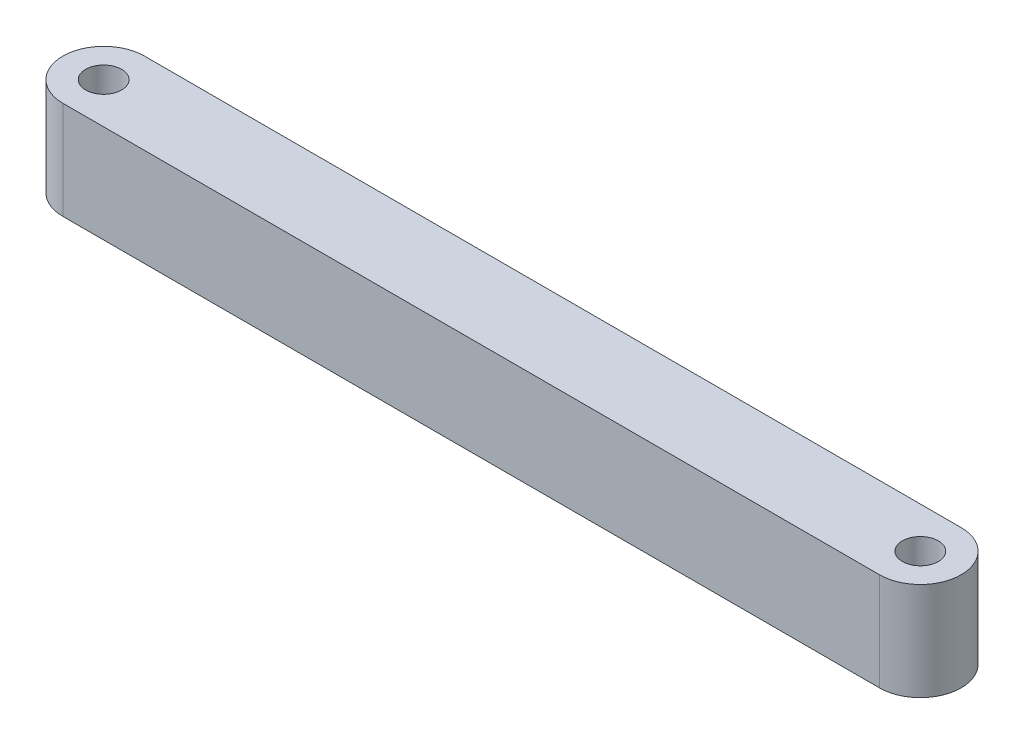
ISO-10303-21;
HEADER;
FILE_DESCRIPTION(('STEP AP214'),'2;1');
FILE_NAME('part.step','',(''),(''),'','','');
FILE_SCHEMA(('AUTOMOTIVE_DESIGN { 1 0 10303 214 1 1 1 1 }'));
ENDSEC;
DATA;
#1=APPLICATION_CONTEXT('core data for automotive mechanical design processes');
#2=APPLICATION_PROTOCOL_DEFINITION('international standard','automotive_design',2000,#1);
#3=PRODUCT_CONTEXT('',#1,'mechanical');
#4=PRODUCT('Part','Part','',(#3));
#5=PRODUCT_RELATED_PRODUCT_CATEGORY('part','',(#4));
#6=PRODUCT_DEFINITION_FORMATION('','',#4);
#7=PRODUCT_DEFINITION_CONTEXT('part definition',#1,'design');
#8=PRODUCT_DEFINITION('design','',#6,#7);
#9=PRODUCT_DEFINITION_SHAPE('','',#8);
#10=(LENGTH_UNIT() NAMED_UNIT(*) SI_UNIT(.MILLI.,.METRE.));
#11=(NAMED_UNIT(*) PLANE_ANGLE_UNIT() SI_UNIT($,.RADIAN.));
#12=(NAMED_UNIT(*) SI_UNIT($,.STERADIAN.) SOLID_ANGLE_UNIT());
#13=UNCERTAINTY_MEASURE_WITH_UNIT(LENGTH_MEASURE(1.E-05),#10,'distance_accuracy_value','');
#14=(GEOMETRIC_REPRESENTATION_CONTEXT(3) GLOBAL_UNCERTAINTY_ASSIGNED_CONTEXT((#13)) GLOBAL_UNIT_ASSIGNED_CONTEXT((#10,
#11,#12)) REPRESENTATION_CONTEXT('',''));
#15=CARTESIAN_POINT('',(0.,0.,0.));
#16=DIRECTION('',(0.,0.,1.));
#17=DIRECTION('',(1.,0.,0.));
#18=AXIS2_PLACEMENT_3D('',#15,#16,#17);
#19=CARTESIAN_POINT('',(93.4644845110648,12.,1.41905282731919));
#20=DIRECTION('',(0.,-1.,0.));
#21=DIRECTION('',(0.,0.,-1.));
#22=AXIS2_PLACEMENT_3D('',#19,#20,#21);
#23=CYLINDRICAL_SURFACE('',#22,2.2);
#24=CARTESIAN_POINT('',(93.4644845110648,12.,1.41905282731919));
#25=DIRECTION('',(0.,1.,0.));
#26=DIRECTION('',(0.,0.,1.));
#27=AXIS2_PLACEMENT_3D('',#24,#25,#26);
#28=CIRCLE('',#27,2.2);
#29=CARTESIAN_POINT('',(93.4644845110648,12.,3.61905282731919));
#30=VERTEX_POINT('',#29);
#31=EDGE_CURVE('E150',#30,#30,#28,.T.);
#32=ORIENTED_EDGE('',*,*,#31,.T.);
#33=EDGE_LOOP('',(#32));
#34=FACE_BOUND('',#33,.T.);
#35=CARTESIAN_POINT('',(93.4644845110648,0.,1.41905282731919));
#36=DIRECTION('',(0.,1.,0.));
#37=DIRECTION('',(0.,0.,1.));
#38=AXIS2_PLACEMENT_3D('',#35,#36,#37);
#39=CIRCLE('',#38,2.2);
#40=CARTESIAN_POINT('',(93.4644845110648,0.,3.61905282731919));
#41=VERTEX_POINT('',#40);
#42=EDGE_CURVE('E166',#41,#41,#39,.T.);
#43=ORIENTED_EDGE('',*,*,#42,.F.);
#44=EDGE_LOOP('',(#43));
#45=FACE_BOUND('',#44,.T.);
#46=ADVANCED_FACE('F83',(#34,#45),#23,.F.);
#47=CARTESIAN_POINT('',(93.4644845110648,12.,1.41905282731919));
#48=DIRECTION('',(0.,-1.,0.));
#49=DIRECTION('',(0.,0.,-1.));
#50=AXIS2_PLACEMENT_3D('',#47,#48,#49);
#51=CYLINDRICAL_SURFACE('',#50,4.99999999999999);
#52=CARTESIAN_POINT('',(93.4644845110648,0.,1.41905282731919));
#53=DIRECTION('',(0.,1.,0.));
#54=DIRECTION('',(0.,0.,1.));
#55=AXIS2_PLACEMENT_3D('',#52,#53,#54);
#56=CIRCLE('',#55,4.99999999999999);
#57=CARTESIAN_POINT('',(93.4644845110648,0.,6.41905282731918));
#58=VERTEX_POINT('',#57);
#59=CARTESIAN_POINT('',(93.4644845110648,0.,-3.5809471726808));
#60=VERTEX_POINT('',#59);
#61=EDGE_CURVE('E142',#58,#60,#56,.T.);
#62=ORIENTED_EDGE('',*,*,#61,.T.);
#63=DIRECTION('',(0.,-1.,0.));
#64=VECTOR('',#63,1.);
#65=CARTESIAN_POINT('',(93.4644845110648,12.,-3.5809471726808));
#66=LINE('',#65,#64);
#67=CARTESIAN_POINT('',(93.4644845110648,12.,-3.5809471726808));
#68=VERTEX_POINT('',#67);
#69=EDGE_CURVE('E94',#68,#60,#66,.T.);
#70=ORIENTED_EDGE('',*,*,#69,.F.);
#71=CARTESIAN_POINT('',(93.4644845110648,12.,1.41905282731919));
#72=DIRECTION('',(0.,1.,0.));
#73=DIRECTION('',(0.,0.,1.));
#74=AXIS2_PLACEMENT_3D('',#71,#72,#73);
#75=CIRCLE('',#74,4.99999999999999);
#76=CARTESIAN_POINT('',(93.4644845110648,12.,6.41905282731918));
#77=VERTEX_POINT('',#76);
#78=EDGE_CURVE('E128',#77,#68,#75,.T.);
#79=ORIENTED_EDGE('',*,*,#78,.F.);
#80=DIRECTION('',(0.,-1.,0.));
#81=VECTOR('',#80,1.);
#82=CARTESIAN_POINT('',(93.4644845110648,12.,6.41905282731918));
#83=LINE('',#82,#81);
#84=EDGE_CURVE('E12',#77,#58,#83,.T.);
#85=ORIENTED_EDGE('',*,*,#84,.T.);
#86=EDGE_LOOP('',(#62,#70,#79,#85));
#87=FACE_BOUND('',#86,.T.);
#88=ADVANCED_FACE('F141',(#87),#51,.T.);
#89=CARTESIAN_POINT('',(0.,12.,-3.580947172681));
#90=DIRECTION('',(0.,0.,1.));
#91=DIRECTION('',(1.,0.,0.));
#92=AXIS2_PLACEMENT_3D('',#89,#90,#91);
#93=PLANE('',#92);
#94=DIRECTION('',(-1.,0.,0.));
#95=VECTOR('',#94,1.);
#96=CARTESIAN_POINT('',(0.,0.,-3.580947172681));
#97=LINE('',#96,#95);
#98=CARTESIAN_POINT('',(-6.53551548893521,0.,-3.58094717268081));
#99=VERTEX_POINT('',#98);
#100=EDGE_CURVE('E163',#60,#99,#97,.T.);
#101=ORIENTED_EDGE('',*,*,#100,.T.);
#102=DIRECTION('',(0.,-1.,0.));
#103=VECTOR('',#102,1.);
#104=CARTESIAN_POINT('',(-6.53551548893521,12.,-3.58094717268081));
#105=LINE('',#104,#103);
#106=CARTESIAN_POINT('',(-6.53551548893521,12.,-3.58094717268081));
#107=VERTEX_POINT('',#106);
#108=EDGE_CURVE('E117',#107,#99,#105,.T.);
#109=ORIENTED_EDGE('',*,*,#108,.F.);
#110=DIRECTION('',(-1.,0.,0.));
#111=VECTOR('',#110,1.);
#112=CARTESIAN_POINT('',(0.,12.,-3.580947172681));
#113=LINE('',#112,#111);
#114=EDGE_CURVE('E135',#68,#107,#113,.T.);
#115=ORIENTED_EDGE('',*,*,#114,.F.);
#116=ORIENTED_EDGE('',*,*,#69,.T.);
#117=EDGE_LOOP('',(#101,#109,#115,#116));
#118=FACE_BOUND('',#117,.T.);
#119=ADVANCED_FACE('F148',(#118),#93,.F.);
#120=CARTESIAN_POINT('',(0.,12.,6.41905282731919));
#121=DIRECTION('',(0.,0.,-1.));
#122=DIRECTION('',(-1.,0.,0.));
#123=AXIS2_PLACEMENT_3D('',#120,#121,#122);
#124=PLANE('',#123);
#125=DIRECTION('',(1.,0.,0.));
#126=VECTOR('',#125,1.);
#127=CARTESIAN_POINT('',(0.,0.,6.41905282731919));
#128=LINE('',#127,#126);
#129=CARTESIAN_POINT('',(-6.53551548893521,0.,6.41905282731919));
#130=VERTEX_POINT('',#129);
#131=EDGE_CURVE('E157',#130,#58,#128,.T.);
#132=ORIENTED_EDGE('',*,*,#131,.T.);
#133=ORIENTED_EDGE('',*,*,#84,.F.);
#134=DIRECTION('',(1.,0.,0.));
#135=VECTOR('',#134,1.);
#136=CARTESIAN_POINT('',(0.,12.,6.41905282731919));
#137=LINE('',#136,#135);
#138=CARTESIAN_POINT('',(-6.53551548893521,12.,6.41905282731919));
#139=VERTEX_POINT('',#138);
#140=EDGE_CURVE('E136',#139,#77,#137,.T.);
#141=ORIENTED_EDGE('',*,*,#140,.F.);
#142=DIRECTION('',(0.,-1.,0.));
#143=VECTOR('',#142,1.);
#144=CARTESIAN_POINT('',(-6.53551548893521,12.,6.41905282731919));
#145=LINE('',#144,#143);
#146=EDGE_CURVE('E103',#139,#130,#145,.T.);
#147=ORIENTED_EDGE('',*,*,#146,.T.);
#148=EDGE_LOOP('',(#132,#133,#141,#147));
#149=FACE_BOUND('',#148,.T.);
#150=ADVANCED_FACE('F187',(#149),#124,.F.);
#151=CARTESIAN_POINT('',(0.,0.,0.));
#152=DIRECTION('',(0.,1.,0.));
#153=DIRECTION('',(0.,0.,1.));
#154=AXIS2_PLACEMENT_3D('',#151,#152,#153);
#155=PLANE('',#154);
#156=ORIENTED_EDGE('',*,*,#131,.F.);
#157=CARTESIAN_POINT('',(-6.53551548893521,0.,1.41905282731919));
#158=DIRECTION('',(0.,1.,0.));
#159=DIRECTION('',(0.,0.,1.));
#160=AXIS2_PLACEMENT_3D('',#157,#158,#159);
#161=CIRCLE('',#160,5.);
#162=EDGE_CURVE('E87',#99,#130,#161,.T.);
#163=ORIENTED_EDGE('',*,*,#162,.F.);
#164=ORIENTED_EDGE('',*,*,#100,.F.);
#165=ORIENTED_EDGE('',*,*,#61,.F.);
#166=EDGE_LOOP('',(#156,#163,#164,#165));
#167=FACE_BOUND('',#166,.T.);
#168=ORIENTED_EDGE('',*,*,#42,.T.);
#169=EDGE_LOOP('',(#168));
#170=FACE_BOUND('',#169,.T.);
#171=CARTESIAN_POINT('',(-6.53551548893521,0.,1.41905282731919));
#172=DIRECTION('',(0.,1.,0.));
#173=DIRECTION('',(0.,0.,1.));
#174=AXIS2_PLACEMENT_3D('',#171,#172,#173);
#175=CIRCLE('',#174,2.2);
#176=CARTESIAN_POINT('',(-6.53551548893521,0.,3.61905282731919));
#177=VERTEX_POINT('',#176);
#178=EDGE_CURVE('E178',#177,#177,#175,.T.);
#179=ORIENTED_EDGE('',*,*,#178,.T.);
#180=EDGE_LOOP('',(#179));
#181=FACE_BOUND('',#180,.T.);
#182=ADVANCED_FACE('F185',(#167,#170,#181),#155,.F.);
#183=CARTESIAN_POINT('',(0.,12.,0.));
#184=DIRECTION('',(0.,1.,0.));
#185=DIRECTION('',(0.,0.,1.));
#186=AXIS2_PLACEMENT_3D('',#183,#184,#185);
#187=PLANE('',#186);
#188=ORIENTED_EDGE('',*,*,#140,.T.);
#189=ORIENTED_EDGE('',*,*,#78,.T.);
#190=ORIENTED_EDGE('',*,*,#114,.T.);
#191=CARTESIAN_POINT('',(-6.53551548893521,12.,1.41905282731919));
#192=DIRECTION('',(0.,1.,0.));
#193=DIRECTION('',(0.,0.,1.));
#194=AXIS2_PLACEMENT_3D('',#191,#192,#193);
#195=CIRCLE('',#194,5.);
#196=EDGE_CURVE('E160',#107,#139,#195,.T.);
#197=ORIENTED_EDGE('',*,*,#196,.T.);
#198=EDGE_LOOP('',(#188,#189,#190,#197));
#199=FACE_BOUND('',#198,.T.);
#200=ORIENTED_EDGE('',*,*,#31,.F.);
#201=EDGE_LOOP('',(#200));
#202=FACE_BOUND('',#201,.T.);
#203=CARTESIAN_POINT('',(-6.53551548893521,12.,1.41905282731919));
#204=DIRECTION('',(0.,1.,0.));
#205=DIRECTION('',(0.,0.,1.));
#206=AXIS2_PLACEMENT_3D('',#203,#204,#205);
#207=CIRCLE('',#206,2.2);
#208=CARTESIAN_POINT('',(-6.53551548893521,12.,3.61905282731919));
#209=VERTEX_POINT('',#208);
#210=EDGE_CURVE('E174',#209,#209,#207,.T.);
#211=ORIENTED_EDGE('',*,*,#210,.F.);
#212=EDGE_LOOP('',(#211));
#213=FACE_BOUND('',#212,.T.);
#214=ADVANCED_FACE('F132',(#199,#202,#213),#187,.T.);
#215=CARTESIAN_POINT('',(-6.53551548893521,12.,1.41905282731919));
#216=DIRECTION('',(0.,-1.,0.));
#217=DIRECTION('',(0.,0.,-1.));
#218=AXIS2_PLACEMENT_3D('',#215,#216,#217);
#219=CYLINDRICAL_SURFACE('',#218,2.2);
#220=ORIENTED_EDGE('',*,*,#210,.T.);
#221=EDGE_LOOP('',(#220));
#222=FACE_BOUND('',#221,.T.);
#223=ORIENTED_EDGE('',*,*,#178,.F.);
#224=EDGE_LOOP('',(#223));
#225=FACE_BOUND('',#224,.T.);
#226=ADVANCED_FACE('F207',(#222,#225),#219,.F.);
#227=CARTESIAN_POINT('',(-6.53551548893521,12.,1.41905282731919));
#228=DIRECTION('',(0.,-1.,0.));
#229=DIRECTION('',(0.,0.,-1.));
#230=AXIS2_PLACEMENT_3D('',#227,#228,#229);
#231=CYLINDRICAL_SURFACE('',#230,5.);
#232=ORIENTED_EDGE('',*,*,#162,.T.);
#233=ORIENTED_EDGE('',*,*,#146,.F.);
#234=ORIENTED_EDGE('',*,*,#196,.F.);
#235=ORIENTED_EDGE('',*,*,#108,.T.);
#236=EDGE_LOOP('',(#232,#233,#234,#235));
#237=FACE_BOUND('',#236,.T.);
#238=ADVANCED_FACE('F85',(#237),#231,.T.);
#239=CLOSED_SHELL('',(#46,#88,#119,#150,#182,#214,#226,#238));
#240=MANIFOLD_SOLID_BREP('B2',#239);
#241=ADVANCED_BREP_SHAPE_REPRESENTATION('',(#18,#240),#14);
#242=SHAPE_DEFINITION_REPRESENTATION(#9,#241);
ENDSEC;
END-ISO-10303-21;
